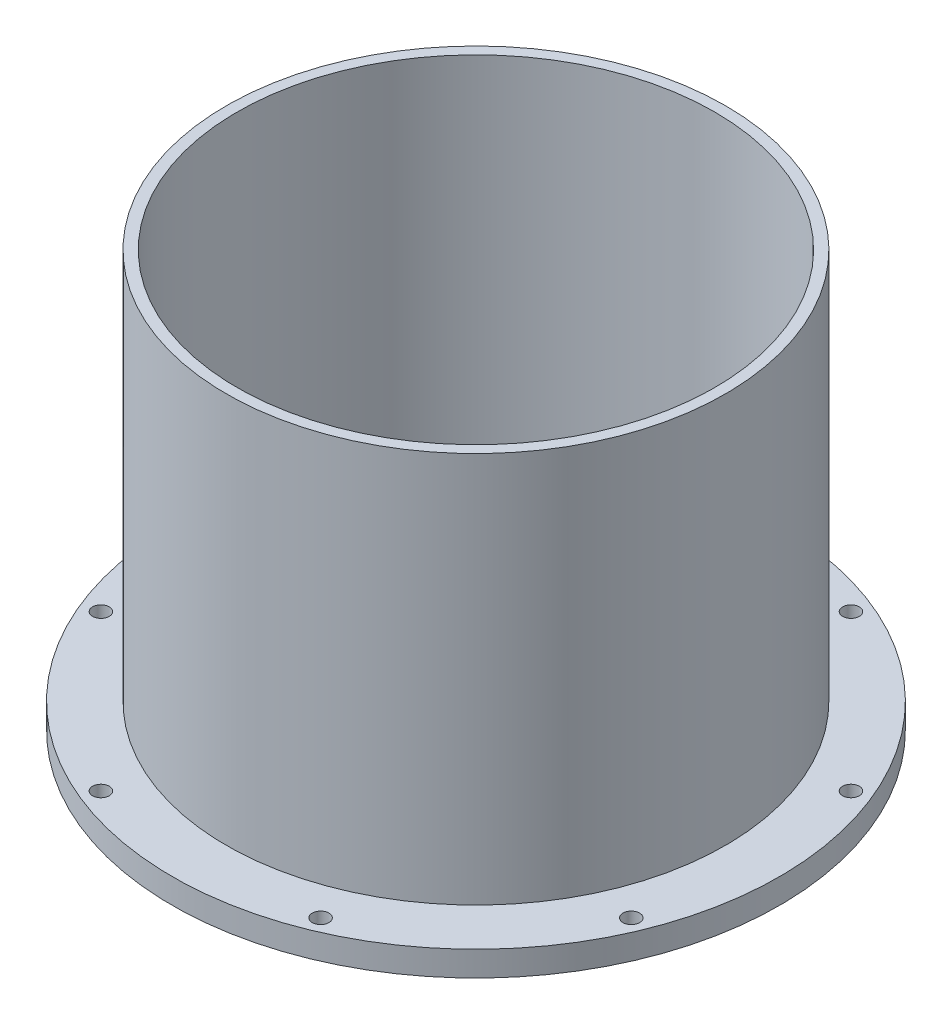
ISO-10303-21;
HEADER;
FILE_DESCRIPTION(('STEP AP214'),'2;1');
FILE_NAME('part.step','',(''),(''),'','','');
FILE_SCHEMA(('AUTOMOTIVE_DESIGN { 1 0 10303 214 1 1 1 1 }'));
ENDSEC;
DATA;
#1=APPLICATION_CONTEXT('core data for automotive mechanical design processes');
#2=APPLICATION_PROTOCOL_DEFINITION('international standard','automotive_design',2000,#1);
#3=PRODUCT_CONTEXT('',#1,'mechanical');
#4=PRODUCT('Part','Part','',(#3));
#5=PRODUCT_RELATED_PRODUCT_CATEGORY('part','',(#4));
#6=PRODUCT_DEFINITION_FORMATION('','',#4);
#7=PRODUCT_DEFINITION_CONTEXT('part definition',#1,'design');
#8=PRODUCT_DEFINITION('design','',#6,#7);
#9=PRODUCT_DEFINITION_SHAPE('','',#8);
#10=(LENGTH_UNIT() NAMED_UNIT(*) SI_UNIT(.MILLI.,.METRE.));
#11=(NAMED_UNIT(*) PLANE_ANGLE_UNIT() SI_UNIT($,.RADIAN.));
#12=(NAMED_UNIT(*) SI_UNIT($,.STERADIAN.) SOLID_ANGLE_UNIT());
#13=UNCERTAINTY_MEASURE_WITH_UNIT(LENGTH_MEASURE(1.E-05),#10,'distance_accuracy_value','');
#14=(GEOMETRIC_REPRESENTATION_CONTEXT(3) GLOBAL_UNCERTAINTY_ASSIGNED_CONTEXT((#13)) GLOBAL_UNIT_ASSIGNED_CONTEXT((#10,
#11,#12)) REPRESENTATION_CONTEXT('',''));
#15=CARTESIAN_POINT('',(0.,0.,0.));
#16=DIRECTION('',(0.,0.,1.));
#17=DIRECTION('',(1.,0.,0.));
#18=AXIS2_PLACEMENT_3D('',#15,#16,#17);
#19=CARTESIAN_POINT('',(150.,250.,0.));
#20=DIRECTION('',(0.,1.,0.));
#21=DIRECTION('',(0.,0.,1.));
#22=AXIS2_PLACEMENT_3D('',#19,#20,#21);
#23=PLANE('',#22);
#24=CARTESIAN_POINT('',(0.,250.,0.));
#25=DIRECTION('',(0.,-1.,0.));
#26=DIRECTION('',(0.,0.,-1.));
#27=AXIS2_PLACEMENT_3D('',#24,#25,#26);
#28=CIRCLE('',#27,143.5);
#29=CARTESIAN_POINT('',(0.,250.,-143.5));
#30=VERTEX_POINT('',#29);
#31=EDGE_CURVE('E10',#30,#30,#28,.T.);
#32=ORIENTED_EDGE('',*,*,#31,.T.);
#33=EDGE_LOOP('',(#32));
#34=FACE_BOUND('',#33,.T.);
#35=CARTESIAN_POINT('',(0.,250.,0.));
#36=DIRECTION('',(0.,-1.,0.));
#37=DIRECTION('',(0.,0.,-1.));
#38=AXIS2_PLACEMENT_3D('',#35,#36,#37);
#39=CIRCLE('',#38,150.);
#40=CARTESIAN_POINT('',(0.,250.,-150.));
#41=VERTEX_POINT('',#40);
#42=EDGE_CURVE('E56',#41,#41,#39,.T.);
#43=ORIENTED_EDGE('',*,*,#42,.F.);
#44=EDGE_LOOP('',(#43));
#45=FACE_BOUND('',#44,.T.);
#46=ADVANCED_FACE('F37',(#34,#45),#23,.T.);
#47=CARTESIAN_POINT('',(0.,0.,0.));
#48=DIRECTION('',(0.,-1.,0.));
#49=DIRECTION('',(0.,0.,-1.));
#50=AXIS2_PLACEMENT_3D('',#47,#48,#49);
#51=CYLINDRICAL_SURFACE('',#50,143.5);
#52=CARTESIAN_POINT('',(0.,0.,0.));
#53=DIRECTION('',(0.,-1.,0.));
#54=DIRECTION('',(0.,0.,-1.));
#55=AXIS2_PLACEMENT_3D('',#52,#53,#54);
#56=CIRCLE('',#55,143.5);
#57=CARTESIAN_POINT('',(0.,0.,-143.5));
#58=VERTEX_POINT('',#57);
#59=EDGE_CURVE('E44',#58,#58,#56,.T.);
#60=ORIENTED_EDGE('',*,*,#59,.T.);
#61=EDGE_LOOP('',(#60));
#62=FACE_BOUND('',#61,.T.);
#63=ORIENTED_EDGE('',*,*,#31,.F.);
#64=EDGE_LOOP('',(#63));
#65=FACE_BOUND('',#64,.T.);
#66=ADVANCED_FACE('F115',(#62,#65),#51,.F.);
#67=CARTESIAN_POINT('',(143.5,0.,0.));
#68=DIRECTION('',(0.,-1.,0.));
#69=DIRECTION('',(0.,0.,-1.));
#70=AXIS2_PLACEMENT_3D('',#67,#68,#69);
#71=PLANE('',#70);
#72=CARTESIAN_POINT('',(159.369219358196,0.,66.0128920829792));
#73=DIRECTION('',(0.,1.,0.));
#74=DIRECTION('',(-0.707106781186549,0.,0.707106781186546));
#75=AXIS2_PLACEMENT_3D('',#72,#73,#74);
#76=CIRCLE('',#75,4.99999999999999);
#77=CARTESIAN_POINT('',(155.833685452264,0.,69.5484259889119));
#78=VERTEX_POINT('',#77);
#79=EDGE_CURVE('E62',#78,#78,#76,.T.);
#80=ORIENTED_EDGE('',*,*,#79,.T.);
#81=EDGE_LOOP('',(#80));
#82=FACE_BOUND('',#81,.T.);
#83=CARTESIAN_POINT('',(66.0128920829765,0.,159.369219358198));
#84=DIRECTION('',(0.,1.,0.));
#85=DIRECTION('',(-1.,0.,0.));
#86=AXIS2_PLACEMENT_3D('',#83,#84,#85);
#87=CIRCLE('',#86,4.99999999999999);
#88=CARTESIAN_POINT('',(61.0128920829765,0.,159.369219358198));
#89=VERTEX_POINT('',#88);
#90=EDGE_CURVE('E168',#89,#89,#87,.T.);
#91=ORIENTED_EDGE('',*,*,#90,.T.);
#92=EDGE_LOOP('',(#91));
#93=FACE_BOUND('',#92,.T.);
#94=CARTESIAN_POINT('',(-66.0128920829798,0.,159.369219358196));
#95=DIRECTION('',(0.,1.,0.));
#96=DIRECTION('',(-0.707106781186544,0.,-0.707106781186551));
#97=AXIS2_PLACEMENT_3D('',#94,#95,#96);
#98=CIRCLE('',#97,4.99999999999999);
#99=CARTESIAN_POINT('',(-69.5484259889125,0.,155.833685452263));
#100=VERTEX_POINT('',#99);
#101=EDGE_CURVE('E171',#100,#100,#98,.T.);
#102=ORIENTED_EDGE('',*,*,#101,.T.);
#103=EDGE_LOOP('',(#102));
#104=FACE_BOUND('',#103,.T.);
#105=CARTESIAN_POINT('',(-159.369219358197,0.,66.012892082977));
#106=DIRECTION('',(0.,1.,0.));
#107=DIRECTION('',(0.,0.,-1.));
#108=AXIS2_PLACEMENT_3D('',#105,#106,#107);
#109=CIRCLE('',#108,4.99999999999999);
#110=CARTESIAN_POINT('',(-159.369219358197,0.,61.012892082977));
#111=VERTEX_POINT('',#110);
#112=EDGE_CURVE('E176',#111,#111,#109,.T.);
#113=ORIENTED_EDGE('',*,*,#112,.T.);
#114=EDGE_LOOP('',(#113));
#115=FACE_BOUND('',#114,.T.);
#116=CARTESIAN_POINT('',(-159.369219358196,0.,-66.0128920829803));
#117=DIRECTION('',(0.,1.,0.));
#118=DIRECTION('',(0.707106781186554,0.,-0.707106781186541));
#119=AXIS2_PLACEMENT_3D('',#116,#117,#118);
#120=CIRCLE('',#119,4.99999999999999);
#121=CARTESIAN_POINT('',(-155.833685452263,0.,-69.548425988913));
#122=VERTEX_POINT('',#121);
#123=EDGE_CURVE('E179',#122,#122,#120,.T.);
#124=ORIENTED_EDGE('',*,*,#123,.T.);
#125=EDGE_LOOP('',(#124));
#126=FACE_BOUND('',#125,.T.);
#127=CARTESIAN_POINT('',(-66.0128920829754,0.,-159.369219358198));
#128=DIRECTION('',(0.,1.,0.));
#129=DIRECTION('',(1.,0.,0.));
#130=AXIS2_PLACEMENT_3D('',#127,#128,#129);
#131=CIRCLE('',#130,4.99999999999999);
#132=CARTESIAN_POINT('',(-61.0128920829754,0.,-159.369219358198));
#133=VERTEX_POINT('',#132);
#134=EDGE_CURVE('E181',#133,#133,#131,.T.);
#135=ORIENTED_EDGE('',*,*,#134,.T.);
#136=EDGE_LOOP('',(#135));
#137=FACE_BOUND('',#136,.T.);
#138=CARTESIAN_POINT('',(66.0128920829809,0.,-159.369219358196));
#139=DIRECTION('',(0.,1.,0.));
#140=DIRECTION('',(0.707106781186539,0.,0.707106781186556));
#141=AXIS2_PLACEMENT_3D('',#138,#139,#140);
#142=CIRCLE('',#141,4.99999999999999);
#143=CARTESIAN_POINT('',(69.5484259889136,0.,-155.833685452263));
#144=VERTEX_POINT('',#143);
#145=EDGE_CURVE('E86',#144,#144,#142,.T.);
#146=ORIENTED_EDGE('',*,*,#145,.T.);
#147=EDGE_LOOP('',(#146));
#148=FACE_BOUND('',#147,.T.);
#149=CARTESIAN_POINT('',(159.369219358197,0.,-66.012892082977));
#150=DIRECTION('',(0.,1.,0.));
#151=DIRECTION('',(0.,0.,1.));
#152=AXIS2_PLACEMENT_3D('',#149,#150,#151);
#153=CIRCLE('',#152,4.99999999999999);
#154=CARTESIAN_POINT('',(159.369219358197,0.,-61.012892082977));
#155=VERTEX_POINT('',#154);
#156=EDGE_CURVE('E57',#155,#155,#153,.T.);
#157=ORIENTED_EDGE('',*,*,#156,.T.);
#158=EDGE_LOOP('',(#157));
#159=FACE_BOUND('',#158,.T.);
#160=CARTESIAN_POINT('',(0.,0.,0.));
#161=DIRECTION('',(0.,-1.,0.));
#162=DIRECTION('',(0.,0.,-1.));
#163=AXIS2_PLACEMENT_3D('',#160,#161,#162);
#164=CIRCLE('',#163,182.5);
#165=CARTESIAN_POINT('',(0.,0.,-182.5));
#166=VERTEX_POINT('',#165);
#167=EDGE_CURVE('E49',#166,#166,#164,.T.);
#168=ORIENTED_EDGE('',*,*,#167,.T.);
#169=EDGE_LOOP('',(#168));
#170=FACE_BOUND('',#169,.T.);
#171=ORIENTED_EDGE('',*,*,#59,.F.);
#172=EDGE_LOOP('',(#171));
#173=FACE_BOUND('',#172,.T.);
#174=ADVANCED_FACE('F98',(#82,#93,#104,#115,#126,#137,#148,#159,#170,#173),#71,.T.);
#175=CARTESIAN_POINT('',(0.,0.,0.));
#176=DIRECTION('',(0.,-1.,0.));
#177=DIRECTION('',(0.,0.,-1.));
#178=AXIS2_PLACEMENT_3D('',#175,#176,#177);
#179=CYLINDRICAL_SURFACE('',#178,182.5);
#180=CARTESIAN_POINT('',(0.,15.,0.));
#181=DIRECTION('',(0.,-1.,0.));
#182=DIRECTION('',(0.,0.,-1.));
#183=AXIS2_PLACEMENT_3D('',#180,#181,#182);
#184=CIRCLE('',#183,182.5);
#185=CARTESIAN_POINT('',(0.,15.,-182.5));
#186=VERTEX_POINT('',#185);
#187=EDGE_CURVE('E93',#186,#186,#184,.T.);
#188=ORIENTED_EDGE('',*,*,#187,.T.);
#189=EDGE_LOOP('',(#188));
#190=FACE_BOUND('',#189,.T.);
#191=ORIENTED_EDGE('',*,*,#167,.F.);
#192=EDGE_LOOP('',(#191));
#193=FACE_BOUND('',#192,.T.);
#194=ADVANCED_FACE('F101',(#190,#193),#179,.T.);
#195=CARTESIAN_POINT('',(182.5,15.,0.));
#196=DIRECTION('',(0.,1.,0.));
#197=DIRECTION('',(0.,0.,1.));
#198=AXIS2_PLACEMENT_3D('',#195,#196,#197);
#199=PLANE('',#198);
#200=CARTESIAN_POINT('',(159.369219358196,15.,66.0128920829792));
#201=DIRECTION('',(0.,1.,0.));
#202=DIRECTION('',(0.,0.,1.));
#203=AXIS2_PLACEMENT_3D('',#200,#201,#202);
#204=CIRCLE('',#203,4.99999999999999);
#205=CARTESIAN_POINT('',(159.369219358196,15.,71.0128920829792));
#206=VERTEX_POINT('',#205);
#207=EDGE_CURVE('E40',#206,#206,#204,.T.);
#208=ORIENTED_EDGE('',*,*,#207,.F.);
#209=EDGE_LOOP('',(#208));
#210=FACE_BOUND('',#209,.T.);
#211=CARTESIAN_POINT('',(66.0128920829765,15.,159.369219358198));
#212=DIRECTION('',(0.,1.,0.));
#213=DIRECTION('',(0.,0.,1.));
#214=AXIS2_PLACEMENT_3D('',#211,#212,#213);
#215=CIRCLE('',#214,4.99999999999999);
#216=CARTESIAN_POINT('',(66.0128920829765,15.,164.369219358198));
#217=VERTEX_POINT('',#216);
#218=EDGE_CURVE('E73',#217,#217,#215,.T.);
#219=ORIENTED_EDGE('',*,*,#218,.F.);
#220=EDGE_LOOP('',(#219));
#221=FACE_BOUND('',#220,.T.);
#222=CARTESIAN_POINT('',(-66.0128920829798,15.,159.369219358196));
#223=DIRECTION('',(0.,1.,0.));
#224=DIRECTION('',(0.,0.,1.));
#225=AXIS2_PLACEMENT_3D('',#222,#223,#224);
#226=CIRCLE('',#225,4.99999999999999);
#227=CARTESIAN_POINT('',(-66.0128920829798,15.,164.369219358196));
#228=VERTEX_POINT('',#227);
#229=EDGE_CURVE('E71',#228,#228,#226,.T.);
#230=ORIENTED_EDGE('',*,*,#229,.F.);
#231=EDGE_LOOP('',(#230));
#232=FACE_BOUND('',#231,.T.);
#233=CARTESIAN_POINT('',(-159.369219358197,15.,66.012892082977));
#234=DIRECTION('',(0.,1.,0.));
#235=DIRECTION('',(0.,0.,1.));
#236=AXIS2_PLACEMENT_3D('',#233,#234,#235);
#237=CIRCLE('',#236,4.99999999999999);
#238=CARTESIAN_POINT('',(-159.369219358197,15.,71.012892082977));
#239=VERTEX_POINT('',#238);
#240=EDGE_CURVE('E68',#239,#239,#237,.T.);
#241=ORIENTED_EDGE('',*,*,#240,.F.);
#242=EDGE_LOOP('',(#241));
#243=FACE_BOUND('',#242,.T.);
#244=CARTESIAN_POINT('',(-159.369219358196,15.,-66.0128920829803));
#245=DIRECTION('',(0.,1.,0.));
#246=DIRECTION('',(0.,0.,1.));
#247=AXIS2_PLACEMENT_3D('',#244,#245,#246);
#248=CIRCLE('',#247,4.99999999999999);
#249=CARTESIAN_POINT('',(-159.369219358196,15.,-61.0128920829803));
#250=VERTEX_POINT('',#249);
#251=EDGE_CURVE('E65',#250,#250,#248,.T.);
#252=ORIENTED_EDGE('',*,*,#251,.F.);
#253=EDGE_LOOP('',(#252));
#254=FACE_BOUND('',#253,.T.);
#255=CARTESIAN_POINT('',(-66.0128920829754,15.,-159.369219358198));
#256=DIRECTION('',(0.,1.,0.));
#257=DIRECTION('',(0.,0.,1.));
#258=AXIS2_PLACEMENT_3D('',#255,#256,#257);
#259=CIRCLE('',#258,4.99999999999999);
#260=CARTESIAN_POINT('',(-66.0128920829754,15.,-154.369219358198));
#261=VERTEX_POINT('',#260);
#262=EDGE_CURVE('E61',#261,#261,#259,.T.);
#263=ORIENTED_EDGE('',*,*,#262,.F.);
#264=EDGE_LOOP('',(#263));
#265=FACE_BOUND('',#264,.T.);
#266=CARTESIAN_POINT('',(66.0128920829809,15.,-159.369219358196));
#267=DIRECTION('',(0.,1.,0.));
#268=DIRECTION('',(0.,0.,1.));
#269=AXIS2_PLACEMENT_3D('',#266,#267,#268);
#270=CIRCLE('',#269,4.99999999999999);
#271=CARTESIAN_POINT('',(66.0128920829809,15.,-154.369219358196));
#272=VERTEX_POINT('',#271);
#273=EDGE_CURVE('E58',#272,#272,#270,.T.);
#274=ORIENTED_EDGE('',*,*,#273,.F.);
#275=EDGE_LOOP('',(#274));
#276=FACE_BOUND('',#275,.T.);
#277=CARTESIAN_POINT('',(159.369219358197,15.,-66.012892082977));
#278=DIRECTION('',(0.,1.,0.));
#279=DIRECTION('',(0.,0.,1.));
#280=AXIS2_PLACEMENT_3D('',#277,#278,#279);
#281=CIRCLE('',#280,4.99999999999999);
#282=CARTESIAN_POINT('',(159.369219358197,15.,-61.012892082977));
#283=VERTEX_POINT('',#282);
#284=EDGE_CURVE('E53',#283,#283,#281,.T.);
#285=ORIENTED_EDGE('',*,*,#284,.F.);
#286=EDGE_LOOP('',(#285));
#287=FACE_BOUND('',#286,.T.);
#288=CARTESIAN_POINT('',(0.,15.,0.));
#289=DIRECTION('',(0.,-1.,0.));
#290=DIRECTION('',(0.,0.,-1.));
#291=AXIS2_PLACEMENT_3D('',#288,#289,#290);
#292=CIRCLE('',#291,150.);
#293=CARTESIAN_POINT('',(0.,15.,-150.));
#294=VERTEX_POINT('',#293);
#295=EDGE_CURVE('E90',#294,#294,#292,.T.);
#296=ORIENTED_EDGE('',*,*,#295,.T.);
#297=EDGE_LOOP('',(#296));
#298=FACE_BOUND('',#297,.T.);
#299=ORIENTED_EDGE('',*,*,#187,.F.);
#300=EDGE_LOOP('',(#299));
#301=FACE_BOUND('',#300,.T.);
#302=ADVANCED_FACE('F103',(#210,#221,#232,#243,#254,#265,#276,#287,#298,#301),#199,.T.);
#303=CARTESIAN_POINT('',(0.,0.,0.));
#304=DIRECTION('',(0.,-1.,0.));
#305=DIRECTION('',(0.,0.,-1.));
#306=AXIS2_PLACEMENT_3D('',#303,#304,#305);
#307=CYLINDRICAL_SURFACE('',#306,150.);
#308=ORIENTED_EDGE('',*,*,#42,.T.);
#309=EDGE_LOOP('',(#308));
#310=FACE_BOUND('',#309,.T.);
#311=ORIENTED_EDGE('',*,*,#295,.F.);
#312=EDGE_LOOP('',(#311));
#313=FACE_BOUND('',#312,.T.);
#314=ADVANCED_FACE('F111',(#310,#313),#307,.T.);
#315=CARTESIAN_POINT('',(159.369219358197,0.,-66.012892082977));
#316=DIRECTION('',(0.,1.,0.));
#317=DIRECTION('',(0.,0.,1.));
#318=AXIS2_PLACEMENT_3D('',#315,#316,#317);
#319=CYLINDRICAL_SURFACE('',#318,4.99999999999999);
#320=ORIENTED_EDGE('',*,*,#284,.T.);
#321=EDGE_LOOP('',(#320));
#322=FACE_BOUND('',#321,.T.);
#323=ORIENTED_EDGE('',*,*,#156,.F.);
#324=EDGE_LOOP('',(#323));
#325=FACE_BOUND('',#324,.T.);
#326=ADVANCED_FACE('F126',(#322,#325),#319,.F.);
#327=CARTESIAN_POINT('',(66.0128920829809,0.,-159.369219358196));
#328=DIRECTION('',(0.,1.,0.));
#329=DIRECTION('',(0.,0.,1.));
#330=AXIS2_PLACEMENT_3D('',#327,#328,#329);
#331=CYLINDRICAL_SURFACE('',#330,4.99999999999999);
#332=ORIENTED_EDGE('',*,*,#273,.T.);
#333=EDGE_LOOP('',(#332));
#334=FACE_BOUND('',#333,.T.);
#335=ORIENTED_EDGE('',*,*,#145,.F.);
#336=EDGE_LOOP('',(#335));
#337=FACE_BOUND('',#336,.T.);
#338=ADVANCED_FACE('F135',(#334,#337),#331,.F.);
#339=CARTESIAN_POINT('',(-66.0128920829754,0.,-159.369219358198));
#340=DIRECTION('',(0.,1.,0.));
#341=DIRECTION('',(0.,0.,1.));
#342=AXIS2_PLACEMENT_3D('',#339,#340,#341);
#343=CYLINDRICAL_SURFACE('',#342,4.99999999999999);
#344=ORIENTED_EDGE('',*,*,#262,.T.);
#345=EDGE_LOOP('',(#344));
#346=FACE_BOUND('',#345,.T.);
#347=ORIENTED_EDGE('',*,*,#134,.F.);
#348=EDGE_LOOP('',(#347));
#349=FACE_BOUND('',#348,.T.);
#350=ADVANCED_FACE('F141',(#346,#349),#343,.F.);
#351=CARTESIAN_POINT('',(-159.369219358196,0.,-66.0128920829803));
#352=DIRECTION('',(0.,1.,0.));
#353=DIRECTION('',(0.,0.,1.));
#354=AXIS2_PLACEMENT_3D('',#351,#352,#353);
#355=CYLINDRICAL_SURFACE('',#354,4.99999999999999);
#356=ORIENTED_EDGE('',*,*,#251,.T.);
#357=EDGE_LOOP('',(#356));
#358=FACE_BOUND('',#357,.T.);
#359=ORIENTED_EDGE('',*,*,#123,.F.);
#360=EDGE_LOOP('',(#359));
#361=FACE_BOUND('',#360,.T.);
#362=ADVANCED_FACE('F145',(#358,#361),#355,.F.);
#363=CARTESIAN_POINT('',(-159.369219358197,0.,66.012892082977));
#364=DIRECTION('',(0.,1.,0.));
#365=DIRECTION('',(0.,0.,1.));
#366=AXIS2_PLACEMENT_3D('',#363,#364,#365);
#367=CYLINDRICAL_SURFACE('',#366,4.99999999999999);
#368=ORIENTED_EDGE('',*,*,#240,.T.);
#369=EDGE_LOOP('',(#368));
#370=FACE_BOUND('',#369,.T.);
#371=ORIENTED_EDGE('',*,*,#112,.F.);
#372=EDGE_LOOP('',(#371));
#373=FACE_BOUND('',#372,.T.);
#374=ADVANCED_FACE('F149',(#370,#373),#367,.F.);
#375=CARTESIAN_POINT('',(-66.0128920829798,0.,159.369219358196));
#376=DIRECTION('',(0.,1.,0.));
#377=DIRECTION('',(0.,0.,1.));
#378=AXIS2_PLACEMENT_3D('',#375,#376,#377);
#379=CYLINDRICAL_SURFACE('',#378,4.99999999999999);
#380=ORIENTED_EDGE('',*,*,#229,.T.);
#381=EDGE_LOOP('',(#380));
#382=FACE_BOUND('',#381,.T.);
#383=ORIENTED_EDGE('',*,*,#101,.F.);
#384=EDGE_LOOP('',(#383));
#385=FACE_BOUND('',#384,.T.);
#386=ADVANCED_FACE('F153',(#382,#385),#379,.F.);
#387=CARTESIAN_POINT('',(66.0128920829765,0.,159.369219358198));
#388=DIRECTION('',(0.,1.,0.));
#389=DIRECTION('',(0.,0.,1.));
#390=AXIS2_PLACEMENT_3D('',#387,#388,#389);
#391=CYLINDRICAL_SURFACE('',#390,4.99999999999999);
#392=ORIENTED_EDGE('',*,*,#218,.T.);
#393=EDGE_LOOP('',(#392));
#394=FACE_BOUND('',#393,.T.);
#395=ORIENTED_EDGE('',*,*,#90,.F.);
#396=EDGE_LOOP('',(#395));
#397=FACE_BOUND('',#396,.T.);
#398=ADVANCED_FACE('F157',(#394,#397),#391,.F.);
#399=CARTESIAN_POINT('',(159.369219358196,0.,66.0128920829792));
#400=DIRECTION('',(0.,1.,0.));
#401=DIRECTION('',(0.,0.,1.));
#402=AXIS2_PLACEMENT_3D('',#399,#400,#401);
#403=CYLINDRICAL_SURFACE('',#402,4.99999999999999);
#404=ORIENTED_EDGE('',*,*,#207,.T.);
#405=EDGE_LOOP('',(#404));
#406=FACE_BOUND('',#405,.T.);
#407=ORIENTED_EDGE('',*,*,#79,.F.);
#408=EDGE_LOOP('',(#407));
#409=FACE_BOUND('',#408,.T.);
#410=ADVANCED_FACE('F161',(#406,#409),#403,.F.);
#411=CLOSED_SHELL('',(#46,#66,#174,#194,#302,#314,#326,#338,#350,#362,#374,#386,#398,#410));
#412=MANIFOLD_SOLID_BREP('B2',#411);
#413=ADVANCED_BREP_SHAPE_REPRESENTATION('',(#18,#412),#14);
#414=SHAPE_DEFINITION_REPRESENTATION(#9,#413);
ENDSEC;
END-ISO-10303-21;
